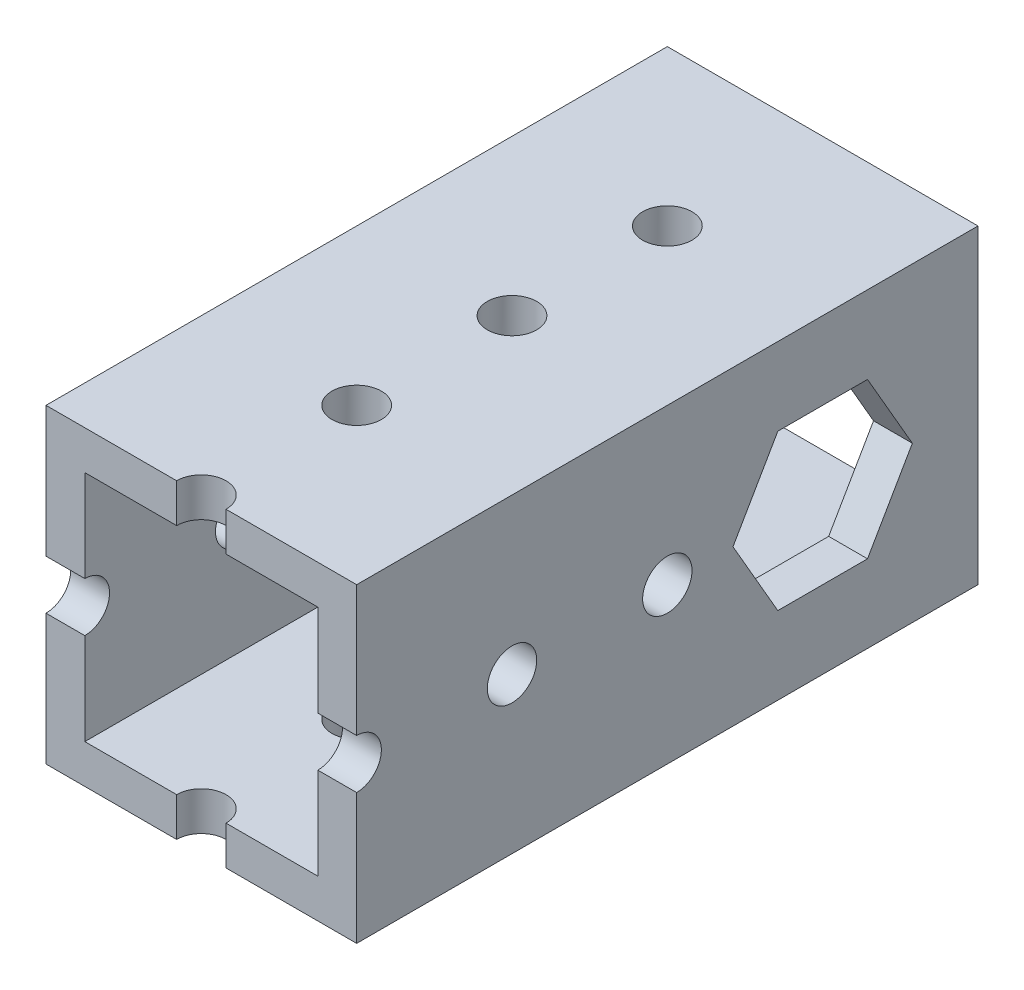
ISO-10303-21;
HEADER;
FILE_DESCRIPTION(('STEP AP214'),'2;1');
FILE_NAME('part.step','',(''),(''),'','','');
FILE_SCHEMA(('AUTOMOTIVE_DESIGN { 1 0 10303 214 1 1 1 1 }'));
ENDSEC;
DATA;
#1=APPLICATION_CONTEXT('core data for automotive mechanical design processes');
#2=APPLICATION_PROTOCOL_DEFINITION('international standard','automotive_design',2000,#1);
#3=PRODUCT_CONTEXT('',#1,'mechanical');
#4=PRODUCT('Part','Part','',(#3));
#5=PRODUCT_RELATED_PRODUCT_CATEGORY('part','',(#4));
#6=PRODUCT_DEFINITION_FORMATION('','',#4);
#7=PRODUCT_DEFINITION_CONTEXT('part definition',#1,'design');
#8=PRODUCT_DEFINITION('design','',#6,#7);
#9=PRODUCT_DEFINITION_SHAPE('','',#8);
#10=(LENGTH_UNIT() NAMED_UNIT(*) SI_UNIT(.MILLI.,.METRE.));
#11=(NAMED_UNIT(*) PLANE_ANGLE_UNIT() SI_UNIT($,.RADIAN.));
#12=(NAMED_UNIT(*) SI_UNIT($,.STERADIAN.) SOLID_ANGLE_UNIT());
#13=UNCERTAINTY_MEASURE_WITH_UNIT(LENGTH_MEASURE(1.E-05),#10,'distance_accuracy_value','');
#14=(GEOMETRIC_REPRESENTATION_CONTEXT(3) GLOBAL_UNCERTAINTY_ASSIGNED_CONTEXT((#13)) GLOBAL_UNIT_ASSIGNED_CONTEXT((#10,
#11,#12)) REPRESENTATION_CONTEXT('',''));
#15=CARTESIAN_POINT('',(0.,0.,0.));
#16=DIRECTION('',(0.,0.,1.));
#17=DIRECTION('',(1.,0.,0.));
#18=AXIS2_PLACEMENT_3D('',#15,#16,#17);
#19=CARTESIAN_POINT('',(0.,0.,63.5));
#20=DIRECTION('',(1.,0.,0.));
#21=DIRECTION('',(0.,0.,-1.));
#22=AXIS2_PLACEMENT_3D('',#19,#20,#21);
#23=PLANE('',#22);
#24=CARTESIAN_POINT('',(0.,12.7,25.4));
#25=DIRECTION('',(1.,0.,0.));
#26=DIRECTION('',(0.,0.,-1.));
#27=AXIS2_PLACEMENT_3D('',#24,#25,#26);
#28=CIRCLE('',#27,2.0193);
#29=CARTESIAN_POINT('',(0.,12.7,23.3807));
#30=VERTEX_POINT('',#29);
#31=EDGE_CURVE('E298',#30,#30,#28,.T.);
#32=ORIENTED_EDGE('',*,*,#31,.T.);
#33=EDGE_LOOP('',(#32));
#34=FACE_BOUND('',#33,.T.);
#35=CARTESIAN_POINT('',(0.,12.7,38.1));
#36=DIRECTION('',(1.,0.,0.));
#37=DIRECTION('',(0.,0.,-1.));
#38=AXIS2_PLACEMENT_3D('',#35,#36,#37);
#39=CIRCLE('',#38,2.01929999999999);
#40=CARTESIAN_POINT('',(0.,12.7,36.0807));
#41=VERTEX_POINT('',#40);
#42=EDGE_CURVE('E303',#41,#41,#39,.T.);
#43=ORIENTED_EDGE('',*,*,#42,.T.);
#44=EDGE_LOOP('',(#43));
#45=FACE_BOUND('',#44,.T.);
#46=DIRECTION('',(0.,0.866025403784439,-0.5));
#47=VECTOR('',#46,1.);
#48=CARTESIAN_POINT('',(0.,-21.9970452561247,25.4));
#49=LINE('',#48,#47);
#50=CARTESIAN_POINT('',(0.,6.35,9.03382579064588));
#51=VERTEX_POINT('',#50);
#52=CARTESIAN_POINT('',(0.,12.7,5.36765158129176));
#53=VERTEX_POINT('',#52);
#54=EDGE_CURVE('E555',#51,#53,#49,.T.);
#55=ORIENTED_EDGE('',*,*,#54,.T.);
#56=DIRECTION('',(0.,0.866025403784439,0.5));
#57=VECTOR('',#56,1.);
#58=CARTESIAN_POINT('',(0.,28.3470452561247,14.4014773719376));
#59=LINE('',#58,#57);
#60=CARTESIAN_POINT('',(0.,19.05,9.03382579064588));
#61=VERTEX_POINT('',#60);
#62=EDGE_CURVE('E563',#53,#61,#59,.T.);
#63=ORIENTED_EDGE('',*,*,#62,.T.);
#64=DIRECTION('',(0.,0.,1.));
#65=VECTOR('',#64,1.);
#66=CARTESIAN_POINT('',(0.,19.05,63.5));
#67=LINE('',#66,#65);
#68=CARTESIAN_POINT('',(0.,19.05,16.3661742093541));
#69=VERTEX_POINT('',#68);
#70=EDGE_CURVE('E527',#61,#69,#67,.T.);
#71=ORIENTED_EDGE('',*,*,#70,.T.);
#72=DIRECTION('',(0.,-0.866025403784439,0.5));
#73=VECTOR('',#72,1.);
#74=CARTESIAN_POINT('',(0.,-15.6470452561247,36.3985226280624));
#75=LINE('',#74,#73);
#76=CARTESIAN_POINT('',(0.,12.7,20.0323484187082));
#77=VERTEX_POINT('',#76);
#78=EDGE_CURVE('E534',#69,#77,#75,.T.);
#79=ORIENTED_EDGE('',*,*,#78,.T.);
#80=DIRECTION('',(0.,-0.866025403784439,-0.5));
#81=VECTOR('',#80,1.);
#82=CARTESIAN_POINT('',(0.,21.9970452561247,25.4));
#83=LINE('',#82,#81);
#84=CARTESIAN_POINT('',(0.,6.35,16.3661742093541));
#85=VERTEX_POINT('',#84);
#86=EDGE_CURVE('E541',#77,#85,#83,.T.);
#87=ORIENTED_EDGE('',*,*,#86,.T.);
#88=DIRECTION('',(0.,0.,-1.));
#89=VECTOR('',#88,1.);
#90=CARTESIAN_POINT('',(0.,6.35000000000001,63.5));
#91=LINE('',#90,#89);
#92=EDGE_CURVE('E548',#85,#51,#91,.T.);
#93=ORIENTED_EDGE('',*,*,#92,.T.);
#94=EDGE_LOOP('',(#55,#63,#71,#79,#87,#93));
#95=FACE_BOUND('',#94,.T.);
#96=DIRECTION('',(0.,-1.,0.));
#97=VECTOR('',#96,1.);
#98=CARTESIAN_POINT('',(0.,25.4,50.8));
#99=LINE('',#98,#97);
#100=CARTESIAN_POINT('',(0.,25.4,50.8));
#101=VERTEX_POINT('',#100);
#102=CARTESIAN_POINT('',(0.,14.7193,50.8));
#103=VERTEX_POINT('',#102);
#104=EDGE_CURVE('E232',#101,#103,#99,.T.);
#105=ORIENTED_EDGE('',*,*,#104,.F.);
#106=DIRECTION('',(0.,0.,-1.));
#107=VECTOR('',#106,1.);
#108=CARTESIAN_POINT('',(0.,25.4,63.5));
#109=LINE('',#108,#107);
#110=CARTESIAN_POINT('',(0.,25.4,0.));
#111=VERTEX_POINT('',#110);
#112=EDGE_CURVE('E427',#101,#111,#109,.T.);
#113=ORIENTED_EDGE('',*,*,#112,.T.);
#114=DIRECTION('',(0.,-1.,0.));
#115=VECTOR('',#114,1.);
#116=CARTESIAN_POINT('',(0.,0.,0.));
#117=LINE('',#116,#115);
#118=CARTESIAN_POINT('',(0.,0.,0.));
#119=VERTEX_POINT('',#118);
#120=EDGE_CURVE('E250',#111,#119,#117,.T.);
#121=ORIENTED_EDGE('',*,*,#120,.T.);
#122=DIRECTION('',(0.,0.,-1.));
#123=VECTOR('',#122,1.);
#124=CARTESIAN_POINT('',(0.,0.,63.5));
#125=LINE('',#124,#123);
#126=CARTESIAN_POINT('',(0.,0.,50.8));
#127=VERTEX_POINT('',#126);
#128=EDGE_CURVE('E238',#127,#119,#125,.T.);
#129=ORIENTED_EDGE('',*,*,#128,.F.);
#130=CARTESIAN_POINT('',(0.,10.6807,50.8));
#131=VERTEX_POINT('',#130);
#132=EDGE_CURVE('E221',#131,#127,#99,.T.);
#133=ORIENTED_EDGE('',*,*,#132,.F.);
#134=CARTESIAN_POINT('',(0.,12.7,50.8));
#135=DIRECTION('',(1.,0.,0.));
#136=DIRECTION('',(0.,0.,-1.));
#137=AXIS2_PLACEMENT_3D('',#134,#135,#136);
#138=CIRCLE('',#137,2.0193);
#139=EDGE_CURVE('E342',#131,#103,#138,.T.);
#140=ORIENTED_EDGE('',*,*,#139,.T.);
#141=EDGE_LOOP('',(#105,#113,#121,#129,#133,#140));
#142=FACE_BOUND('',#141,.T.);
#143=ADVANCED_FACE('F38',(#34,#45,#95,#142),#23,.F.);
#144=CARTESIAN_POINT('',(0.,0.,63.5));
#145=DIRECTION('',(0.,1.,0.));
#146=DIRECTION('',(0.,0.,1.));
#147=AXIS2_PLACEMENT_3D('',#144,#145,#146);
#148=PLANE('',#147);
#149=CARTESIAN_POINT('',(12.7,0.,12.7));
#150=DIRECTION('',(0.,1.,0.));
#151=DIRECTION('',(0.,0.,1.));
#152=AXIS2_PLACEMENT_3D('',#149,#150,#151);
#153=CIRCLE('',#152,2.0193);
#154=CARTESIAN_POINT('',(12.7,0.,14.7193));
#155=VERTEX_POINT('',#154);
#156=EDGE_CURVE('E274',#155,#155,#153,.T.);
#157=ORIENTED_EDGE('',*,*,#156,.T.);
#158=EDGE_LOOP('',(#157));
#159=FACE_BOUND('',#158,.T.);
#160=CARTESIAN_POINT('',(12.7,0.,25.4));
#161=DIRECTION('',(0.,1.,0.));
#162=DIRECTION('',(0.,0.,1.));
#163=AXIS2_PLACEMENT_3D('',#160,#161,#162);
#164=CIRCLE('',#163,2.0193);
#165=CARTESIAN_POINT('',(12.7,0.,27.4193));
#166=VERTEX_POINT('',#165);
#167=EDGE_CURVE('E280',#166,#166,#164,.T.);
#168=ORIENTED_EDGE('',*,*,#167,.T.);
#169=EDGE_LOOP('',(#168));
#170=FACE_BOUND('',#169,.T.);
#171=CARTESIAN_POINT('',(12.7,0.,38.1));
#172=DIRECTION('',(0.,1.,0.));
#173=DIRECTION('',(0.,0.,1.));
#174=AXIS2_PLACEMENT_3D('',#171,#172,#173);
#175=CIRCLE('',#174,2.0193);
#176=CARTESIAN_POINT('',(12.7,0.,40.1193));
#177=VERTEX_POINT('',#176);
#178=EDGE_CURVE('E286',#177,#177,#175,.T.);
#179=ORIENTED_EDGE('',*,*,#178,.T.);
#180=EDGE_LOOP('',(#179));
#181=FACE_BOUND('',#180,.T.);
#182=DIRECTION('',(1.,0.,0.));
#183=VECTOR('',#182,1.);
#184=CARTESIAN_POINT('',(0.,0.,50.8));
#185=LINE('',#184,#183);
#186=CARTESIAN_POINT('',(10.6807,0.,50.8));
#187=VERTEX_POINT('',#186);
#188=EDGE_CURVE('E224',#127,#187,#185,.T.);
#189=ORIENTED_EDGE('',*,*,#188,.F.);
#190=ORIENTED_EDGE('',*,*,#128,.T.);
#191=DIRECTION('',(1.,0.,0.));
#192=VECTOR('',#191,1.);
#193=CARTESIAN_POINT('',(0.,0.,0.));
#194=LINE('',#193,#192);
#195=CARTESIAN_POINT('',(25.4,0.,0.));
#196=VERTEX_POINT('',#195);
#197=EDGE_CURVE('E416',#119,#196,#194,.T.);
#198=ORIENTED_EDGE('',*,*,#197,.T.);
#199=DIRECTION('',(0.,0.,-1.));
#200=VECTOR('',#199,1.);
#201=CARTESIAN_POINT('',(25.4,0.,63.5));
#202=LINE('',#201,#200);
#203=CARTESIAN_POINT('',(25.4,0.,50.8));
#204=VERTEX_POINT('',#203);
#205=EDGE_CURVE('E253',#204,#196,#202,.T.);
#206=ORIENTED_EDGE('',*,*,#205,.F.);
#207=CARTESIAN_POINT('',(14.7193,0.,50.8));
#208=VERTEX_POINT('',#207);
#209=EDGE_CURVE('E245',#208,#204,#185,.T.);
#210=ORIENTED_EDGE('',*,*,#209,.F.);
#211=CARTESIAN_POINT('',(12.7,0.,50.8));
#212=DIRECTION('',(0.,1.,0.));
#213=DIRECTION('',(0.,0.,1.));
#214=AXIS2_PLACEMENT_3D('',#211,#212,#213);
#215=CIRCLE('',#214,2.0193);
#216=EDGE_CURVE('E242',#208,#187,#215,.T.);
#217=ORIENTED_EDGE('',*,*,#216,.T.);
#218=EDGE_LOOP('',(#189,#190,#198,#206,#210,#217));
#219=FACE_BOUND('',#218,.T.);
#220=ADVANCED_FACE('F236',(#159,#170,#181,#219),#148,.F.);
#221=CARTESIAN_POINT('',(25.4,0.,63.5));
#222=DIRECTION('',(-1.,0.,0.));
#223=DIRECTION('',(0.,0.,1.));
#224=AXIS2_PLACEMENT_3D('',#221,#222,#223);
#225=PLANE('',#224);
#226=CARTESIAN_POINT('',(25.4,12.7,25.4));
#227=DIRECTION('',(1.,0.,0.));
#228=DIRECTION('',(0.,0.,-1.));
#229=AXIS2_PLACEMENT_3D('',#226,#227,#228);
#230=CIRCLE('',#229,2.0193);
#231=CARTESIAN_POINT('',(25.4,12.7,23.3807));
#232=VERTEX_POINT('',#231);
#233=EDGE_CURVE('E567',#232,#232,#230,.T.);
#234=ORIENTED_EDGE('',*,*,#233,.F.);
#235=EDGE_LOOP('',(#234));
#236=FACE_BOUND('',#235,.T.);
#237=CARTESIAN_POINT('',(25.4,12.7,38.1));
#238=DIRECTION('',(1.,0.,0.));
#239=DIRECTION('',(0.,0.,-1.));
#240=AXIS2_PLACEMENT_3D('',#237,#238,#239);
#241=CIRCLE('',#240,2.01929999999999);
#242=CARTESIAN_POINT('',(25.4,12.7,36.0807));
#243=VERTEX_POINT('',#242);
#244=EDGE_CURVE('E571',#243,#243,#241,.T.);
#245=ORIENTED_EDGE('',*,*,#244,.F.);
#246=EDGE_LOOP('',(#245));
#247=FACE_BOUND('',#246,.T.);
#248=DIRECTION('',(0.,0.,1.));
#249=VECTOR('',#248,1.);
#250=CARTESIAN_POINT('',(25.4,19.05,9.03382579064588));
#251=LINE('',#250,#249);
#252=CARTESIAN_POINT('',(25.4,19.05,9.03382579064588));
#253=VERTEX_POINT('',#252);
#254=CARTESIAN_POINT('',(25.4,19.05,16.3661742093541));
#255=VERTEX_POINT('',#254);
#256=EDGE_CURVE('E479',#253,#255,#251,.T.);
#257=ORIENTED_EDGE('',*,*,#256,.F.);
#258=DIRECTION('',(0.,0.866025403784439,0.5));
#259=VECTOR('',#258,1.);
#260=CARTESIAN_POINT('',(25.4,12.7,5.36765158129176));
#261=LINE('',#260,#259);
#262=CARTESIAN_POINT('',(25.4,12.7,5.36765158129176));
#263=VERTEX_POINT('',#262);
#264=EDGE_CURVE('E476',#263,#253,#261,.T.);
#265=ORIENTED_EDGE('',*,*,#264,.F.);
#266=DIRECTION('',(0.,0.866025403784438,-0.5));
#267=VECTOR('',#266,1.);
#268=CARTESIAN_POINT('',(25.4,6.35,9.03382579064588));
#269=LINE('',#268,#267);
#270=CARTESIAN_POINT('',(25.4,6.35,9.03382579064588));
#271=VERTEX_POINT('',#270);
#272=EDGE_CURVE('E495',#271,#263,#269,.T.);
#273=ORIENTED_EDGE('',*,*,#272,.F.);
#274=DIRECTION('',(0.,0.,-1.));
#275=VECTOR('',#274,1.);
#276=CARTESIAN_POINT('',(25.4,6.35,16.3661742093541));
#277=LINE('',#276,#275);
#278=CARTESIAN_POINT('',(25.4,6.35,16.3661742093541));
#279=VERTEX_POINT('',#278);
#280=EDGE_CURVE('E491',#279,#271,#277,.T.);
#281=ORIENTED_EDGE('',*,*,#280,.F.);
#282=DIRECTION('',(0.,-0.866025403784439,-0.5));
#283=VECTOR('',#282,1.);
#284=CARTESIAN_POINT('',(25.4,12.7,20.0323484187082));
#285=LINE('',#284,#283);
#286=CARTESIAN_POINT('',(25.4,12.7,20.0323484187082));
#287=VERTEX_POINT('',#286);
#288=EDGE_CURVE('E487',#287,#279,#285,.T.);
#289=ORIENTED_EDGE('',*,*,#288,.F.);
#290=DIRECTION('',(0.,-0.866025403784439,0.5));
#291=VECTOR('',#290,1.);
#292=CARTESIAN_POINT('',(25.4,19.05,16.3661742093541));
#293=LINE('',#292,#291);
#294=EDGE_CURVE('E483',#255,#287,#293,.T.);
#295=ORIENTED_EDGE('',*,*,#294,.F.);
#296=EDGE_LOOP('',(#257,#265,#273,#281,#289,#295));
#297=FACE_BOUND('',#296,.T.);
#298=DIRECTION('',(0.,1.,0.));
#299=VECTOR('',#298,1.);
#300=CARTESIAN_POINT('',(25.4,25.4,50.8));
#301=LINE('',#300,#299);
#302=CARTESIAN_POINT('',(25.4,10.6807,50.8));
#303=VERTEX_POINT('',#302);
#304=EDGE_CURVE('E53',#204,#303,#301,.T.);
#305=ORIENTED_EDGE('',*,*,#304,.F.);
#306=ORIENTED_EDGE('',*,*,#205,.T.);
#307=DIRECTION('',(0.,1.,0.));
#308=VECTOR('',#307,1.);
#309=CARTESIAN_POINT('',(25.4,0.,0.));
#310=LINE('',#309,#308);
#311=CARTESIAN_POINT('',(25.4,25.4,0.));
#312=VERTEX_POINT('',#311);
#313=EDGE_CURVE('E419',#196,#312,#310,.T.);
#314=ORIENTED_EDGE('',*,*,#313,.T.);
#315=DIRECTION('',(0.,0.,-1.));
#316=VECTOR('',#315,1.);
#317=CARTESIAN_POINT('',(25.4,25.4,63.5));
#318=LINE('',#317,#316);
#319=CARTESIAN_POINT('',(25.4,25.4,50.8));
#320=VERTEX_POINT('',#319);
#321=EDGE_CURVE('E259',#320,#312,#318,.T.);
#322=ORIENTED_EDGE('',*,*,#321,.F.);
#323=CARTESIAN_POINT('',(25.4,14.7193,50.8));
#324=VERTEX_POINT('',#323);
#325=EDGE_CURVE('E244',#324,#320,#301,.T.);
#326=ORIENTED_EDGE('',*,*,#325,.F.);
#327=CARTESIAN_POINT('',(25.4,12.7,50.8));
#328=DIRECTION('',(1.,0.,0.));
#329=DIRECTION('',(0.,0.,-1.));
#330=AXIS2_PLACEMENT_3D('',#327,#328,#329);
#331=CIRCLE('',#330,2.0193);
#332=EDGE_CURVE('E292',#303,#324,#331,.T.);
#333=ORIENTED_EDGE('',*,*,#332,.F.);
#334=EDGE_LOOP('',(#305,#306,#314,#322,#326,#333));
#335=FACE_BOUND('',#334,.T.);
#336=ADVANCED_FACE('F440',(#236,#247,#297,#335),#225,.F.);
#337=CARTESIAN_POINT('',(0.,25.4,63.5));
#338=DIRECTION('',(0.,-1.,0.));
#339=DIRECTION('',(0.,0.,-1.));
#340=AXIS2_PLACEMENT_3D('',#337,#338,#339);
#341=PLANE('',#340);
#342=CARTESIAN_POINT('',(12.7,25.4,12.7));
#343=DIRECTION('',(0.,1.,0.));
#344=DIRECTION('',(0.,0.,1.));
#345=AXIS2_PLACEMENT_3D('',#342,#343,#344);
#346=CIRCLE('',#345,2.0193);
#347=CARTESIAN_POINT('',(12.7,25.4,14.7193));
#348=VERTEX_POINT('',#347);
#349=EDGE_CURVE('E345',#348,#348,#346,.T.);
#350=ORIENTED_EDGE('',*,*,#349,.F.);
#351=EDGE_LOOP('',(#350));
#352=FACE_BOUND('',#351,.T.);
#353=CARTESIAN_POINT('',(12.7,25.4,25.4));
#354=DIRECTION('',(0.,1.,0.));
#355=DIRECTION('',(0.,0.,1.));
#356=AXIS2_PLACEMENT_3D('',#353,#354,#355);
#357=CIRCLE('',#356,2.0193);
#358=CARTESIAN_POINT('',(12.7,25.4,27.4193));
#359=VERTEX_POINT('',#358);
#360=EDGE_CURVE('E357',#359,#359,#357,.T.);
#361=ORIENTED_EDGE('',*,*,#360,.F.);
#362=EDGE_LOOP('',(#361));
#363=FACE_BOUND('',#362,.T.);
#364=CARTESIAN_POINT('',(12.7,25.4,38.1));
#365=DIRECTION('',(0.,1.,0.));
#366=DIRECTION('',(0.,0.,1.));
#367=AXIS2_PLACEMENT_3D('',#364,#365,#366);
#368=CIRCLE('',#367,2.0193);
#369=CARTESIAN_POINT('',(12.7,25.4,40.1193));
#370=VERTEX_POINT('',#369);
#371=EDGE_CURVE('E353',#370,#370,#368,.T.);
#372=ORIENTED_EDGE('',*,*,#371,.F.);
#373=EDGE_LOOP('',(#372));
#374=FACE_BOUND('',#373,.T.);
#375=DIRECTION('',(-1.,0.,0.));
#376=VECTOR('',#375,1.);
#377=CARTESIAN_POINT('',(0.,25.4,50.8));
#378=LINE('',#377,#376);
#379=CARTESIAN_POINT('',(14.7193,25.4,50.8));
#380=VERTEX_POINT('',#379);
#381=EDGE_CURVE('E337',#320,#380,#378,.T.);
#382=ORIENTED_EDGE('',*,*,#381,.F.);
#383=ORIENTED_EDGE('',*,*,#321,.T.);
#384=DIRECTION('',(-1.,0.,0.));
#385=VECTOR('',#384,1.);
#386=CARTESIAN_POINT('',(0.,25.4,0.));
#387=LINE('',#386,#385);
#388=EDGE_CURVE('E423',#312,#111,#387,.T.);
#389=ORIENTED_EDGE('',*,*,#388,.T.);
#390=ORIENTED_EDGE('',*,*,#112,.F.);
#391=CARTESIAN_POINT('',(10.6807,25.4,50.8));
#392=VERTEX_POINT('',#391);
#393=EDGE_CURVE('E764',#392,#101,#378,.T.);
#394=ORIENTED_EDGE('',*,*,#393,.F.);
#395=CARTESIAN_POINT('',(12.7,25.4,50.8));
#396=DIRECTION('',(0.,1.,0.));
#397=DIRECTION('',(0.,0.,1.));
#398=AXIS2_PLACEMENT_3D('',#395,#396,#397);
#399=CIRCLE('',#398,2.0193);
#400=EDGE_CURVE('E268',#380,#392,#399,.T.);
#401=ORIENTED_EDGE('',*,*,#400,.F.);
#402=EDGE_LOOP('',(#382,#383,#389,#390,#394,#401));
#403=FACE_BOUND('',#402,.T.);
#404=ADVANCED_FACE('F433',(#352,#363,#374,#403),#341,.F.);
#405=CARTESIAN_POINT('',(3.175,3.175,63.5));
#406=DIRECTION('',(1.,0.,0.));
#407=DIRECTION('',(0.,0.,-1.));
#408=AXIS2_PLACEMENT_3D('',#405,#406,#407);
#409=PLANE('',#408);
#410=DIRECTION('',(0.,0.866025403784439,0.5));
#411=VECTOR('',#410,1.);
#412=CARTESIAN_POINT('',(3.175,30.7282952561247,15.7762927004454));
#413=LINE('',#412,#411);
#414=CARTESIAN_POINT('',(3.175,12.7,5.36765158129176));
#415=VERTEX_POINT('',#414);
#416=CARTESIAN_POINT('',(3.175,19.05,9.03382579064588));
#417=VERTEX_POINT('',#416);
#418=EDGE_CURVE('E559',#415,#417,#413,.T.);
#419=ORIENTED_EDGE('',*,*,#418,.F.);
#420=DIRECTION('',(0.,0.866025403784439,-0.5));
#421=VECTOR('',#420,1.);
#422=CARTESIAN_POINT('',(3.175,-19.6157952561247,24.0251846714922));
#423=LINE('',#422,#421);
#424=CARTESIAN_POINT('',(3.175,6.35,9.03382579064588));
#425=VERTEX_POINT('',#424);
#426=EDGE_CURVE('E552',#425,#415,#423,.T.);
#427=ORIENTED_EDGE('',*,*,#426,.F.);
#428=DIRECTION('',(0.,0.,-1.));
#429=VECTOR('',#428,1.);
#430=CARTESIAN_POINT('',(3.175,6.35000000000001,63.5));
#431=LINE('',#430,#429);
#432=CARTESIAN_POINT('',(3.175,6.35,16.3661742093541));
#433=VERTEX_POINT('',#432);
#434=EDGE_CURVE('E545',#433,#425,#431,.T.);
#435=ORIENTED_EDGE('',*,*,#434,.F.);
#436=DIRECTION('',(0.,-0.866025403784439,-0.5));
#437=VECTOR('',#436,1.);
#438=CARTESIAN_POINT('',(3.175,24.3782952561247,26.7748153285078));
#439=LINE('',#438,#437);
#440=CARTESIAN_POINT('',(3.175,12.7,20.0323484187082));
#441=VERTEX_POINT('',#440);
#442=EDGE_CURVE('E538',#441,#433,#439,.T.);
#443=ORIENTED_EDGE('',*,*,#442,.F.);
#444=DIRECTION('',(0.,-0.866025403784439,0.5));
#445=VECTOR('',#444,1.);
#446=CARTESIAN_POINT('',(3.175,-13.2657952561247,35.0237072995546));
#447=LINE('',#446,#445);
#448=CARTESIAN_POINT('',(3.175,19.05,16.3661742093541));
#449=VERTEX_POINT('',#448);
#450=EDGE_CURVE('E531',#449,#441,#447,.T.);
#451=ORIENTED_EDGE('',*,*,#450,.F.);
#452=DIRECTION('',(0.,0.,1.));
#453=VECTOR('',#452,1.);
#454=CARTESIAN_POINT('',(3.175,19.05,63.5));
#455=LINE('',#454,#453);
#456=EDGE_CURVE('E524',#417,#449,#455,.T.);
#457=ORIENTED_EDGE('',*,*,#456,.F.);
#458=EDGE_LOOP('',(#419,#427,#435,#443,#451,#457));
#459=FACE_BOUND('',#458,.T.);
#460=CARTESIAN_POINT('',(3.175,12.7,38.1));
#461=DIRECTION('',(1.,0.,0.));
#462=DIRECTION('',(0.,0.,-1.));
#463=AXIS2_PLACEMENT_3D('',#460,#461,#462);
#464=CIRCLE('',#463,2.01929999999999);
#465=CARTESIAN_POINT('',(3.175,12.7,36.0807));
#466=VERTEX_POINT('',#465);
#467=EDGE_CURVE('E297',#466,#466,#464,.T.);
#468=ORIENTED_EDGE('',*,*,#467,.F.);
#469=EDGE_LOOP('',(#468));
#470=FACE_BOUND('',#469,.T.);
#471=CARTESIAN_POINT('',(3.175,12.7,25.4));
#472=DIRECTION('',(1.,0.,0.));
#473=DIRECTION('',(0.,0.,-1.));
#474=AXIS2_PLACEMENT_3D('',#471,#472,#473);
#475=CIRCLE('',#474,2.0193);
#476=CARTESIAN_POINT('',(3.175,12.7,23.3807));
#477=VERTEX_POINT('',#476);
#478=EDGE_CURVE('E291',#477,#477,#475,.T.);
#479=ORIENTED_EDGE('',*,*,#478,.F.);
#480=EDGE_LOOP('',(#479));
#481=FACE_BOUND('',#480,.T.);
#482=DIRECTION('',(0.,0.,-1.));
#483=VECTOR('',#482,1.);
#484=CARTESIAN_POINT('',(3.175,22.225,63.5));
#485=LINE('',#484,#483);
#486=CARTESIAN_POINT('',(3.175,22.225,50.8));
#487=VERTEX_POINT('',#486);
#488=CARTESIAN_POINT('',(3.175,22.225,0.));
#489=VERTEX_POINT('',#488);
#490=EDGE_CURVE('E334',#487,#489,#485,.T.);
#491=ORIENTED_EDGE('',*,*,#490,.F.);
#492=DIRECTION('',(0.,-1.,0.));
#493=VECTOR('',#492,1.);
#494=CARTESIAN_POINT('',(3.175,3.175,50.8));
#495=LINE('',#494,#493);
#496=CARTESIAN_POINT('',(3.175,14.7193,50.8));
#497=VERTEX_POINT('',#496);
#498=EDGE_CURVE('E324',#487,#497,#495,.T.);
#499=ORIENTED_EDGE('',*,*,#498,.T.);
#500=CARTESIAN_POINT('',(3.175,12.7,50.8));
#501=DIRECTION('',(1.,0.,0.));
#502=DIRECTION('',(0.,0.,-1.));
#503=AXIS2_PLACEMENT_3D('',#500,#501,#502);
#504=CIRCLE('',#503,2.0193);
#505=CARTESIAN_POINT('',(3.175,10.6807,50.8));
#506=VERTEX_POINT('',#505);
#507=EDGE_CURVE('E302',#506,#497,#504,.T.);
#508=ORIENTED_EDGE('',*,*,#507,.F.);
#509=CARTESIAN_POINT('',(3.175,3.175,50.8));
#510=VERTEX_POINT('',#509);
#511=EDGE_CURVE('E339',#506,#510,#495,.T.);
#512=ORIENTED_EDGE('',*,*,#511,.T.);
#513=DIRECTION('',(0.,0.,-1.));
#514=VECTOR('',#513,1.);
#515=CARTESIAN_POINT('',(3.175,3.175,63.5));
#516=LINE('',#515,#514);
#517=CARTESIAN_POINT('',(3.175,3.175,0.));
#518=VERTEX_POINT('',#517);
#519=EDGE_CURVE('E411',#510,#518,#516,.T.);
#520=ORIENTED_EDGE('',*,*,#519,.T.);
#521=DIRECTION('',(0.,-1.,0.));
#522=VECTOR('',#521,1.);
#523=CARTESIAN_POINT('',(3.175,3.175,0.));
#524=LINE('',#523,#522);
#525=EDGE_CURVE('E387',#489,#518,#524,.T.);
#526=ORIENTED_EDGE('',*,*,#525,.F.);
#527=EDGE_LOOP('',(#491,#499,#508,#512,#520,#526));
#528=FACE_BOUND('',#527,.T.);
#529=ADVANCED_FACE('F331',(#459,#470,#481,#528),#409,.T.);
#530=CARTESIAN_POINT('',(3.175,3.175,63.5));
#531=DIRECTION('',(0.,1.,0.));
#532=DIRECTION('',(0.,0.,1.));
#533=AXIS2_PLACEMENT_3D('',#530,#531,#532);
#534=PLANE('',#533);
#535=CARTESIAN_POINT('',(12.7,3.175,38.1));
#536=DIRECTION('',(0.,1.,0.));
#537=DIRECTION('',(0.,0.,1.));
#538=AXIS2_PLACEMENT_3D('',#535,#536,#537);
#539=CIRCLE('',#538,2.0193);
#540=CARTESIAN_POINT('',(12.7,3.175,40.1193));
#541=VERTEX_POINT('',#540);
#542=EDGE_CURVE('E279',#541,#541,#539,.T.);
#543=ORIENTED_EDGE('',*,*,#542,.F.);
#544=EDGE_LOOP('',(#543));
#545=FACE_BOUND('',#544,.T.);
#546=CARTESIAN_POINT('',(12.7,3.175,25.4));
#547=DIRECTION('',(0.,1.,0.));
#548=DIRECTION('',(0.,0.,1.));
#549=AXIS2_PLACEMENT_3D('',#546,#547,#548);
#550=CIRCLE('',#549,2.0193);
#551=CARTESIAN_POINT('',(12.7,3.175,27.4193));
#552=VERTEX_POINT('',#551);
#553=EDGE_CURVE('E273',#552,#552,#550,.T.);
#554=ORIENTED_EDGE('',*,*,#553,.F.);
#555=EDGE_LOOP('',(#554));
#556=FACE_BOUND('',#555,.T.);
#557=CARTESIAN_POINT('',(12.7,3.175,12.7));
#558=DIRECTION('',(0.,1.,0.));
#559=DIRECTION('',(0.,0.,1.));
#560=AXIS2_PLACEMENT_3D('',#557,#558,#559);
#561=CIRCLE('',#560,2.0193);
#562=CARTESIAN_POINT('',(12.7,3.175,14.7193));
#563=VERTEX_POINT('',#562);
#564=EDGE_CURVE('E267',#563,#563,#561,.T.);
#565=ORIENTED_EDGE('',*,*,#564,.F.);
#566=EDGE_LOOP('',(#565));
#567=FACE_BOUND('',#566,.T.);
#568=ORIENTED_EDGE('',*,*,#519,.F.);
#569=DIRECTION('',(1.,0.,0.));
#570=VECTOR('',#569,1.);
#571=CARTESIAN_POINT('',(3.175,3.175,50.8));
#572=LINE('',#571,#570);
#573=CARTESIAN_POINT('',(10.6807,3.175,50.8));
#574=VERTEX_POINT('',#573);
#575=EDGE_CURVE('E455',#510,#574,#572,.T.);
#576=ORIENTED_EDGE('',*,*,#575,.T.);
#577=CARTESIAN_POINT('',(12.7,3.175,50.8));
#578=DIRECTION('',(0.,1.,0.));
#579=DIRECTION('',(0.,0.,1.));
#580=AXIS2_PLACEMENT_3D('',#577,#578,#579);
#581=CIRCLE('',#580,2.0193);
#582=CARTESIAN_POINT('',(14.7193,3.175,50.8));
#583=VERTEX_POINT('',#582);
#584=EDGE_CURVE('E285',#583,#574,#581,.T.);
#585=ORIENTED_EDGE('',*,*,#584,.F.);
#586=CARTESIAN_POINT('',(22.225,3.175,50.8));
#587=VERTEX_POINT('',#586);
#588=EDGE_CURVE('E461',#583,#587,#572,.T.);
#589=ORIENTED_EDGE('',*,*,#588,.T.);
#590=DIRECTION('',(0.,0.,-1.));
#591=VECTOR('',#590,1.);
#592=CARTESIAN_POINT('',(22.225,3.175,63.5));
#593=LINE('',#592,#591);
#594=CARTESIAN_POINT('',(22.225,3.175,0.));
#595=VERTEX_POINT('',#594);
#596=EDGE_CURVE('E408',#587,#595,#593,.T.);
#597=ORIENTED_EDGE('',*,*,#596,.T.);
#598=DIRECTION('',(1.,0.,0.));
#599=VECTOR('',#598,1.);
#600=CARTESIAN_POINT('',(3.175,3.175,0.));
#601=LINE('',#600,#599);
#602=EDGE_CURVE('E391',#518,#595,#601,.T.);
#603=ORIENTED_EDGE('',*,*,#602,.F.);
#604=EDGE_LOOP('',(#568,#576,#585,#589,#597,#603));
#605=FACE_BOUND('',#604,.T.);
#606=ADVANCED_FACE('F637',(#545,#556,#567,#605),#534,.T.);
#607=CARTESIAN_POINT('',(22.225,3.175,63.5));
#608=DIRECTION('',(-1.,0.,0.));
#609=DIRECTION('',(0.,0.,1.));
#610=AXIS2_PLACEMENT_3D('',#607,#608,#609);
#611=PLANE('',#610);
#612=DIRECTION('',(0.,-0.866025403784439,-0.5));
#613=VECTOR('',#612,1.);
#614=CARTESIAN_POINT('',(22.225,30.7282952561247,15.7762927004454));
#615=LINE('',#614,#613);
#616=CARTESIAN_POINT('',(22.225,19.05,9.03382579064588));
#617=VERTEX_POINT('',#616);
#618=CARTESIAN_POINT('',(22.225,12.7,5.36765158129176));
#619=VERTEX_POINT('',#618);
#620=EDGE_CURVE('E317',#617,#619,#615,.T.);
#621=ORIENTED_EDGE('',*,*,#620,.F.);
#622=DIRECTION('',(0.,0.,-1.));
#623=VECTOR('',#622,1.);
#624=CARTESIAN_POINT('',(22.225,19.05,63.5));
#625=LINE('',#624,#623);
#626=CARTESIAN_POINT('',(22.225,19.05,16.3661742093541));
#627=VERTEX_POINT('',#626);
#628=EDGE_CURVE('E252',#627,#617,#625,.T.);
#629=ORIENTED_EDGE('',*,*,#628,.F.);
#630=DIRECTION('',(0.,0.866025403784439,-0.5));
#631=VECTOR('',#630,1.);
#632=CARTESIAN_POINT('',(22.225,-13.2657952561247,35.0237072995546));
#633=LINE('',#632,#631);
#634=CARTESIAN_POINT('',(22.225,12.7,20.0323484187082));
#635=VERTEX_POINT('',#634);
#636=EDGE_CURVE('E257',#635,#627,#633,.T.);
#637=ORIENTED_EDGE('',*,*,#636,.F.);
#638=DIRECTION('',(0.,0.866025403784439,0.5));
#639=VECTOR('',#638,1.);
#640=CARTESIAN_POINT('',(22.225,24.3782952561247,26.7748153285078));
#641=LINE('',#640,#639);
#642=CARTESIAN_POINT('',(22.225,6.35,16.3661742093541));
#643=VERTEX_POINT('',#642);
#644=EDGE_CURVE('E308',#643,#635,#641,.T.);
#645=ORIENTED_EDGE('',*,*,#644,.F.);
#646=DIRECTION('',(0.,0.,1.));
#647=VECTOR('',#646,1.);
#648=CARTESIAN_POINT('',(22.225,6.35000000000001,63.5));
#649=LINE('',#648,#647);
#650=CARTESIAN_POINT('',(22.225,6.35,9.03382579064588));
#651=VERTEX_POINT('',#650);
#652=EDGE_CURVE('E311',#651,#643,#649,.T.);
#653=ORIENTED_EDGE('',*,*,#652,.F.);
#654=DIRECTION('',(0.,-0.866025403784439,0.5));
#655=VECTOR('',#654,1.);
#656=CARTESIAN_POINT('',(22.225,-19.6157952561247,24.0251846714922));
#657=LINE('',#656,#655);
#658=EDGE_CURVE('E314',#619,#651,#657,.T.);
#659=ORIENTED_EDGE('',*,*,#658,.F.);
#660=EDGE_LOOP('',(#621,#629,#637,#645,#653,#659));
#661=FACE_BOUND('',#660,.T.);
#662=CARTESIAN_POINT('',(22.225,12.7,38.1));
#663=DIRECTION('',(-1.,0.,0.));
#664=DIRECTION('',(0.,0.,1.));
#665=AXIS2_PLACEMENT_3D('',#662,#663,#664);
#666=CIRCLE('',#665,2.01929999999999);
#667=CARTESIAN_POINT('',(22.225,12.7,40.1193));
#668=VERTEX_POINT('',#667);
#669=EDGE_CURVE('E293',#668,#668,#666,.T.);
#670=ORIENTED_EDGE('',*,*,#669,.F.);
#671=EDGE_LOOP('',(#670));
#672=FACE_BOUND('',#671,.T.);
#673=CARTESIAN_POINT('',(22.225,12.7,25.4));
#674=DIRECTION('',(-1.,0.,0.));
#675=DIRECTION('',(0.,0.,1.));
#676=AXIS2_PLACEMENT_3D('',#673,#674,#675);
#677=CIRCLE('',#676,2.0193);
#678=CARTESIAN_POINT('',(22.225,12.7,27.4193));
#679=VERTEX_POINT('',#678);
#680=EDGE_CURVE('E287',#679,#679,#677,.T.);
#681=ORIENTED_EDGE('',*,*,#680,.F.);
#682=EDGE_LOOP('',(#681));
#683=FACE_BOUND('',#682,.T.);
#684=ORIENTED_EDGE('',*,*,#596,.F.);
#685=DIRECTION('',(0.,1.,0.));
#686=VECTOR('',#685,1.);
#687=CARTESIAN_POINT('',(22.225,3.175,50.8));
#688=LINE('',#687,#686);
#689=CARTESIAN_POINT('',(22.225,10.6807,50.8));
#690=VERTEX_POINT('',#689);
#691=EDGE_CURVE('E467',#587,#690,#688,.T.);
#692=ORIENTED_EDGE('',*,*,#691,.T.);
#693=CARTESIAN_POINT('',(22.225,12.7,50.8));
#694=DIRECTION('',(-1.,0.,0.));
#695=DIRECTION('',(0.,0.,1.));
#696=AXIS2_PLACEMENT_3D('',#693,#694,#695);
#697=CIRCLE('',#696,2.0193);
#698=CARTESIAN_POINT('',(22.225,14.7193,50.8));
#699=VERTEX_POINT('',#698);
#700=EDGE_CURVE('E299',#699,#690,#697,.T.);
#701=ORIENTED_EDGE('',*,*,#700,.F.);
#702=CARTESIAN_POINT('',(22.225,22.225,50.8));
#703=VERTEX_POINT('',#702);
#704=EDGE_CURVE('E61',#699,#703,#688,.T.);
#705=ORIENTED_EDGE('',*,*,#704,.T.);
#706=DIRECTION('',(0.,0.,-1.));
#707=VECTOR('',#706,1.);
#708=CARTESIAN_POINT('',(22.225,22.225,63.5));
#709=LINE('',#708,#707);
#710=CARTESIAN_POINT('',(22.225,22.225,0.));
#711=VERTEX_POINT('',#710);
#712=EDGE_CURVE('E405',#703,#711,#709,.T.);
#713=ORIENTED_EDGE('',*,*,#712,.T.);
#714=DIRECTION('',(0.,1.,0.));
#715=VECTOR('',#714,1.);
#716=CARTESIAN_POINT('',(22.225,3.175,0.));
#717=LINE('',#716,#715);
#718=EDGE_CURVE('E395',#595,#711,#717,.T.);
#719=ORIENTED_EDGE('',*,*,#718,.F.);
#720=EDGE_LOOP('',(#684,#692,#701,#705,#713,#719));
#721=FACE_BOUND('',#720,.T.);
#722=ADVANCED_FACE('F641',(#661,#672,#683,#721),#611,.T.);
#723=CARTESIAN_POINT('',(3.175,22.225,63.5));
#724=DIRECTION('',(0.,-1.,0.));
#725=DIRECTION('',(0.,0.,-1.));
#726=AXIS2_PLACEMENT_3D('',#723,#724,#725);
#727=PLANE('',#726);
#728=CARTESIAN_POINT('',(12.7,22.225,38.1));
#729=DIRECTION('',(0.,-1.,0.));
#730=DIRECTION('',(0.,0.,-1.));
#731=AXIS2_PLACEMENT_3D('',#728,#729,#730);
#732=CIRCLE('',#731,2.0193);
#733=CARTESIAN_POINT('',(12.7,22.225,36.0807));
#734=VERTEX_POINT('',#733);
#735=EDGE_CURVE('E275',#734,#734,#732,.T.);
#736=ORIENTED_EDGE('',*,*,#735,.F.);
#737=EDGE_LOOP('',(#736));
#738=FACE_BOUND('',#737,.T.);
#739=CARTESIAN_POINT('',(12.7,22.225,25.4));
#740=DIRECTION('',(0.,-1.,0.));
#741=DIRECTION('',(0.,0.,-1.));
#742=AXIS2_PLACEMENT_3D('',#739,#740,#741);
#743=CIRCLE('',#742,2.0193);
#744=CARTESIAN_POINT('',(12.7,22.225,23.3807));
#745=VERTEX_POINT('',#744);
#746=EDGE_CURVE('E269',#745,#745,#743,.T.);
#747=ORIENTED_EDGE('',*,*,#746,.F.);
#748=EDGE_LOOP('',(#747));
#749=FACE_BOUND('',#748,.T.);
#750=CARTESIAN_POINT('',(12.7,22.225,12.7));
#751=DIRECTION('',(0.,-1.,0.));
#752=DIRECTION('',(0.,0.,-1.));
#753=AXIS2_PLACEMENT_3D('',#750,#751,#752);
#754=CIRCLE('',#753,2.0193);
#755=CARTESIAN_POINT('',(12.7,22.225,10.6807));
#756=VERTEX_POINT('',#755);
#757=EDGE_CURVE('E263',#756,#756,#754,.T.);
#758=ORIENTED_EDGE('',*,*,#757,.F.);
#759=EDGE_LOOP('',(#758));
#760=FACE_BOUND('',#759,.T.);
#761=ORIENTED_EDGE('',*,*,#712,.F.);
#762=DIRECTION('',(-1.,0.,0.));
#763=VECTOR('',#762,1.);
#764=CARTESIAN_POINT('',(3.175,22.225,50.8));
#765=LINE('',#764,#763);
#766=CARTESIAN_POINT('',(14.7193,22.225,50.8));
#767=VERTEX_POINT('',#766);
#768=EDGE_CURVE('E466',#703,#767,#765,.T.);
#769=ORIENTED_EDGE('',*,*,#768,.T.);
#770=CARTESIAN_POINT('',(12.7,22.225,50.8));
#771=DIRECTION('',(0.,-1.,0.));
#772=DIRECTION('',(0.,0.,-1.));
#773=AXIS2_PLACEMENT_3D('',#770,#771,#772);
#774=CIRCLE('',#773,2.0193);
#775=CARTESIAN_POINT('',(10.6807,22.225,50.8));
#776=VERTEX_POINT('',#775);
#777=EDGE_CURVE('E281',#776,#767,#774,.T.);
#778=ORIENTED_EDGE('',*,*,#777,.F.);
#779=EDGE_CURVE('E336',#776,#487,#765,.T.);
#780=ORIENTED_EDGE('',*,*,#779,.T.);
#781=ORIENTED_EDGE('',*,*,#490,.T.);
#782=DIRECTION('',(-1.,0.,0.));
#783=VECTOR('',#782,1.);
#784=CARTESIAN_POINT('',(3.175,22.225,0.));
#785=LINE('',#784,#783);
#786=EDGE_CURVE('E399',#711,#489,#785,.T.);
#787=ORIENTED_EDGE('',*,*,#786,.F.);
#788=EDGE_LOOP('',(#761,#769,#778,#780,#781,#787));
#789=FACE_BOUND('',#788,.T.);
#790=ADVANCED_FACE('F645',(#738,#749,#760,#789),#727,.T.);
#791=CARTESIAN_POINT('',(12.7,-38.1,50.8));
#792=DIRECTION('',(0.,1.,0.));
#793=DIRECTION('',(0.,0.,1.));
#794=AXIS2_PLACEMENT_3D('',#791,#792,#793);
#795=CYLINDRICAL_SURFACE('',#794,2.0193);
#796=DIRECTION('',(0.,1.,0.));
#797=VECTOR('',#796,1.);
#798=CARTESIAN_POINT('',(14.7193,-38.1,50.8));
#799=LINE('',#798,#797);
#800=EDGE_CURVE('E468',#380,#767,#799,.F.);
#801=ORIENTED_EDGE('',*,*,#800,.F.);
#802=ORIENTED_EDGE('',*,*,#400,.T.);
#803=DIRECTION('',(0.,1.,0.));
#804=VECTOR('',#803,1.);
#805=CARTESIAN_POINT('',(10.6807,-38.1,50.8));
#806=LINE('',#805,#804);
#807=EDGE_CURVE('E755',#776,#392,#806,.T.);
#808=ORIENTED_EDGE('',*,*,#807,.F.);
#809=ORIENTED_EDGE('',*,*,#777,.T.);
#810=EDGE_LOOP('',(#801,#802,#808,#809));
#811=FACE_BOUND('',#810,.T.);
#812=ADVANCED_FACE('F649',(#811),#795,.F.);
#813=DIRECTION('',(0.,1.,0.));
#814=VECTOR('',#813,1.);
#815=CARTESIAN_POINT('',(14.7193,-38.1,50.8));
#816=LINE('',#815,#814);
#817=EDGE_CURVE('E449',#583,#208,#816,.F.);
#818=ORIENTED_EDGE('',*,*,#817,.F.);
#819=ORIENTED_EDGE('',*,*,#584,.T.);
#820=DIRECTION('',(0.,1.,0.));
#821=VECTOR('',#820,1.);
#822=CARTESIAN_POINT('',(10.6807,-38.1,50.8));
#823=LINE('',#822,#821);
#824=EDGE_CURVE('E451',#187,#574,#823,.T.);
#825=ORIENTED_EDGE('',*,*,#824,.F.);
#826=ORIENTED_EDGE('',*,*,#216,.F.);
#827=EDGE_LOOP('',(#818,#819,#825,#826));
#828=FACE_BOUND('',#827,.T.);
#829=ADVANCED_FACE('F448',(#828),#795,.F.);
#830=CARTESIAN_POINT('',(-38.1,12.7,50.8));
#831=DIRECTION('',(1.,0.,0.));
#832=DIRECTION('',(0.,0.,-1.));
#833=AXIS2_PLACEMENT_3D('',#830,#831,#832);
#834=CYLINDRICAL_SURFACE('',#833,2.0193);
#835=DIRECTION('',(1.,0.,0.));
#836=VECTOR('',#835,1.);
#837=CARTESIAN_POINT('',(-38.1,10.6807,50.8));
#838=LINE('',#837,#836);
#839=EDGE_CURVE('E471',#303,#690,#838,.F.);
#840=ORIENTED_EDGE('',*,*,#839,.F.);
#841=ORIENTED_EDGE('',*,*,#332,.T.);
#842=DIRECTION('',(1.,0.,0.));
#843=VECTOR('',#842,1.);
#844=CARTESIAN_POINT('',(-38.1,14.7193,50.8));
#845=LINE('',#844,#843);
#846=EDGE_CURVE('E454',#699,#324,#845,.T.);
#847=ORIENTED_EDGE('',*,*,#846,.F.);
#848=ORIENTED_EDGE('',*,*,#700,.T.);
#849=EDGE_LOOP('',(#840,#841,#847,#848));
#850=FACE_BOUND('',#849,.T.);
#851=ADVANCED_FACE('F773',(#850),#834,.F.);
#852=DIRECTION('',(1.,0.,0.));
#853=VECTOR('',#852,1.);
#854=CARTESIAN_POINT('',(-38.1,10.6807,50.8));
#855=LINE('',#854,#853);
#856=EDGE_CURVE('E11',#506,#131,#855,.F.);
#857=ORIENTED_EDGE('',*,*,#856,.F.);
#858=ORIENTED_EDGE('',*,*,#507,.T.);
#859=DIRECTION('',(1.,0.,0.));
#860=VECTOR('',#859,1.);
#861=CARTESIAN_POINT('',(-38.1,14.7193,50.8));
#862=LINE('',#861,#860);
#863=EDGE_CURVE('E46',#103,#497,#862,.T.);
#864=ORIENTED_EDGE('',*,*,#863,.F.);
#865=ORIENTED_EDGE('',*,*,#139,.F.);
#866=EDGE_LOOP('',(#857,#858,#864,#865));
#867=FACE_BOUND('',#866,.T.);
#868=ADVANCED_FACE('F340',(#867),#834,.F.);
#869=CARTESIAN_POINT('',(0.,0.,0.));
#870=DIRECTION('',(0.,0.,-1.));
#871=DIRECTION('',(-1.,0.,0.));
#872=AXIS2_PLACEMENT_3D('',#869,#870,#871);
#873=PLANE('',#872);
#874=ORIENTED_EDGE('',*,*,#120,.F.);
#875=ORIENTED_EDGE('',*,*,#388,.F.);
#876=ORIENTED_EDGE('',*,*,#313,.F.);
#877=ORIENTED_EDGE('',*,*,#197,.F.);
#878=EDGE_LOOP('',(#874,#875,#876,#877));
#879=FACE_BOUND('',#878,.T.);
#880=ORIENTED_EDGE('',*,*,#786,.T.);
#881=ORIENTED_EDGE('',*,*,#525,.T.);
#882=ORIENTED_EDGE('',*,*,#602,.T.);
#883=ORIENTED_EDGE('',*,*,#718,.T.);
#884=EDGE_LOOP('',(#880,#881,#882,#883));
#885=FACE_BOUND('',#884,.T.);
#886=ADVANCED_FACE('F443',(#879,#885),#873,.T.);
#887=CARTESIAN_POINT('',(12.7,-38.1,12.7));
#888=DIRECTION('',(0.,1.,0.));
#889=DIRECTION('',(0.,0.,1.));
#890=AXIS2_PLACEMENT_3D('',#887,#888,#889);
#891=CYLINDRICAL_SURFACE('',#890,2.0193);
#892=ORIENTED_EDGE('',*,*,#757,.T.);
#893=EDGE_LOOP('',(#892));
#894=FACE_BOUND('',#893,.T.);
#895=ORIENTED_EDGE('',*,*,#349,.T.);
#896=EDGE_LOOP('',(#895));
#897=FACE_BOUND('',#896,.T.);
#898=ADVANCED_FACE('F634',(#894,#897),#891,.F.);
#899=CARTESIAN_POINT('',(12.7,-38.1,25.4));
#900=DIRECTION('',(0.,1.,0.));
#901=DIRECTION('',(0.,0.,1.));
#902=AXIS2_PLACEMENT_3D('',#899,#900,#901);
#903=CYLINDRICAL_SURFACE('',#902,2.0193);
#904=ORIENTED_EDGE('',*,*,#746,.T.);
#905=EDGE_LOOP('',(#904));
#906=FACE_BOUND('',#905,.T.);
#907=ORIENTED_EDGE('',*,*,#360,.T.);
#908=EDGE_LOOP('',(#907));
#909=FACE_BOUND('',#908,.T.);
#910=ADVANCED_FACE('F653',(#906,#909),#903,.F.);
#911=CARTESIAN_POINT('',(12.7,-38.1,38.1));
#912=DIRECTION('',(0.,1.,0.));
#913=DIRECTION('',(0.,0.,1.));
#914=AXIS2_PLACEMENT_3D('',#911,#912,#913);
#915=CYLINDRICAL_SURFACE('',#914,2.0193);
#916=ORIENTED_EDGE('',*,*,#735,.T.);
#917=EDGE_LOOP('',(#916));
#918=FACE_BOUND('',#917,.T.);
#919=ORIENTED_EDGE('',*,*,#371,.T.);
#920=EDGE_LOOP('',(#919));
#921=FACE_BOUND('',#920,.T.);
#922=ADVANCED_FACE('F658',(#918,#921),#915,.F.);
#923=ORIENTED_EDGE('',*,*,#564,.T.);
#924=EDGE_LOOP('',(#923));
#925=FACE_BOUND('',#924,.T.);
#926=ORIENTED_EDGE('',*,*,#156,.F.);
#927=EDGE_LOOP('',(#926));
#928=FACE_BOUND('',#927,.T.);
#929=ADVANCED_FACE('F655',(#925,#928),#891,.F.);
#930=ORIENTED_EDGE('',*,*,#553,.T.);
#931=EDGE_LOOP('',(#930));
#932=FACE_BOUND('',#931,.T.);
#933=ORIENTED_EDGE('',*,*,#167,.F.);
#934=EDGE_LOOP('',(#933));
#935=FACE_BOUND('',#934,.T.);
#936=ADVANCED_FACE('F660',(#932,#935),#903,.F.);
#937=ORIENTED_EDGE('',*,*,#542,.T.);
#938=EDGE_LOOP('',(#937));
#939=FACE_BOUND('',#938,.T.);
#940=ORIENTED_EDGE('',*,*,#178,.F.);
#941=EDGE_LOOP('',(#940));
#942=FACE_BOUND('',#941,.T.);
#943=ADVANCED_FACE('F664',(#939,#942),#915,.F.);
#944=CARTESIAN_POINT('',(-38.1,12.7,25.4));
#945=DIRECTION('',(1.,0.,0.));
#946=DIRECTION('',(0.,0.,-1.));
#947=AXIS2_PLACEMENT_3D('',#944,#945,#946);
#948=CYLINDRICAL_SURFACE('',#947,2.0193);
#949=ORIENTED_EDGE('',*,*,#680,.T.);
#950=EDGE_LOOP('',(#949));
#951=FACE_BOUND('',#950,.T.);
#952=ORIENTED_EDGE('',*,*,#233,.T.);
#953=EDGE_LOOP('',(#952));
#954=FACE_BOUND('',#953,.T.);
#955=ADVANCED_FACE('F609',(#951,#954),#948,.F.);
#956=CARTESIAN_POINT('',(-38.1,12.7,38.1));
#957=DIRECTION('',(1.,0.,0.));
#958=DIRECTION('',(0.,0.,-1.));
#959=AXIS2_PLACEMENT_3D('',#956,#957,#958);
#960=CYLINDRICAL_SURFACE('',#959,2.01929999999999);
#961=ORIENTED_EDGE('',*,*,#669,.T.);
#962=EDGE_LOOP('',(#961));
#963=FACE_BOUND('',#962,.T.);
#964=ORIENTED_EDGE('',*,*,#244,.T.);
#965=EDGE_LOOP('',(#964));
#966=FACE_BOUND('',#965,.T.);
#967=ADVANCED_FACE('F598',(#963,#966),#960,.F.);
#968=ORIENTED_EDGE('',*,*,#478,.T.);
#969=EDGE_LOOP('',(#968));
#970=FACE_BOUND('',#969,.T.);
#971=ORIENTED_EDGE('',*,*,#31,.F.);
#972=EDGE_LOOP('',(#971));
#973=FACE_BOUND('',#972,.T.);
#974=ADVANCED_FACE('F596',(#970,#973),#948,.F.);
#975=ORIENTED_EDGE('',*,*,#467,.T.);
#976=EDGE_LOOP('',(#975));
#977=FACE_BOUND('',#976,.T.);
#978=ORIENTED_EDGE('',*,*,#42,.F.);
#979=EDGE_LOOP('',(#978));
#980=FACE_BOUND('',#979,.T.);
#981=ADVANCED_FACE('F593',(#977,#980),#960,.F.);
#982=CARTESIAN_POINT('',(-3.30199999999999,19.05,9.03382579064588));
#983=DIRECTION('',(0.,1.,0.));
#984=DIRECTION('',(0.,0.,1.));
#985=AXIS2_PLACEMENT_3D('',#982,#983,#984);
#986=PLANE('',#985);
#987=ORIENTED_EDGE('',*,*,#628,.T.);
#988=DIRECTION('',(1.,0.,0.));
#989=VECTOR('',#988,1.);
#990=CARTESIAN_POINT('',(-3.30199999999999,19.05,9.03382579064588));
#991=LINE('',#990,#989);
#992=EDGE_CURVE('E499',#617,#253,#991,.T.);
#993=ORIENTED_EDGE('',*,*,#992,.T.);
#994=ORIENTED_EDGE('',*,*,#256,.T.);
#995=DIRECTION('',(1.,0.,0.));
#996=VECTOR('',#995,1.);
#997=CARTESIAN_POINT('',(-3.30199999999999,19.05,16.3661742093541));
#998=LINE('',#997,#996);
#999=EDGE_CURVE('E517',#627,#255,#998,.T.);
#1000=ORIENTED_EDGE('',*,*,#999,.F.);
#1001=EDGE_LOOP('',(#987,#993,#994,#1000));
#1002=FACE_BOUND('',#1001,.T.);
#1003=ADVANCED_FACE('F595',(#1002),#986,.F.);
#1004=CARTESIAN_POINT('',(-3.30199999999999,19.05,16.3661742093541));
#1005=DIRECTION('',(0.,0.5,0.866025403784439));
#1006=DIRECTION('',(0.,-0.866025403784439,0.5));
#1007=AXIS2_PLACEMENT_3D('',#1004,#1005,#1006);
#1008=PLANE('',#1007);
#1009=ORIENTED_EDGE('',*,*,#636,.T.);
#1010=ORIENTED_EDGE('',*,*,#999,.T.);
#1011=ORIENTED_EDGE('',*,*,#294,.T.);
#1012=DIRECTION('',(1.,0.,0.));
#1013=VECTOR('',#1012,1.);
#1014=CARTESIAN_POINT('',(-3.30199999999999,12.7,20.0323484187082));
#1015=LINE('',#1014,#1013);
#1016=EDGE_CURVE('E513',#635,#287,#1015,.T.);
#1017=ORIENTED_EDGE('',*,*,#1016,.F.);
#1018=EDGE_LOOP('',(#1009,#1010,#1011,#1017));
#1019=FACE_BOUND('',#1018,.T.);
#1020=ADVANCED_FACE('F603',(#1019),#1008,.F.);
#1021=CARTESIAN_POINT('',(-3.30199999999999,12.7,20.0323484187082));
#1022=DIRECTION('',(0.,-0.5,0.866025403784439));
#1023=DIRECTION('',(0.,-0.866025403784439,-0.5));
#1024=AXIS2_PLACEMENT_3D('',#1021,#1022,#1023);
#1025=PLANE('',#1024);
#1026=ORIENTED_EDGE('',*,*,#644,.T.);
#1027=ORIENTED_EDGE('',*,*,#1016,.T.);
#1028=ORIENTED_EDGE('',*,*,#288,.T.);
#1029=DIRECTION('',(1.,0.,0.));
#1030=VECTOR('',#1029,1.);
#1031=CARTESIAN_POINT('',(-3.30199999999999,6.35,16.3661742093541));
#1032=LINE('',#1031,#1030);
#1033=EDGE_CURVE('E509',#643,#279,#1032,.T.);
#1034=ORIENTED_EDGE('',*,*,#1033,.F.);
#1035=EDGE_LOOP('',(#1026,#1027,#1028,#1034));
#1036=FACE_BOUND('',#1035,.T.);
#1037=ADVANCED_FACE('F703',(#1036),#1025,.F.);
#1038=CARTESIAN_POINT('',(-3.30199999999999,6.35,16.3661742093541));
#1039=DIRECTION('',(0.,-1.,0.));
#1040=DIRECTION('',(0.,0.,-1.));
#1041=AXIS2_PLACEMENT_3D('',#1038,#1039,#1040);
#1042=PLANE('',#1041);
#1043=ORIENTED_EDGE('',*,*,#652,.T.);
#1044=ORIENTED_EDGE('',*,*,#1033,.T.);
#1045=ORIENTED_EDGE('',*,*,#280,.T.);
#1046=DIRECTION('',(1.,0.,0.));
#1047=VECTOR('',#1046,1.);
#1048=CARTESIAN_POINT('',(-3.30199999999999,6.35,9.03382579064588));
#1049=LINE('',#1048,#1047);
#1050=EDGE_CURVE('E505',#651,#271,#1049,.T.);
#1051=ORIENTED_EDGE('',*,*,#1050,.F.);
#1052=EDGE_LOOP('',(#1043,#1044,#1045,#1051));
#1053=FACE_BOUND('',#1052,.T.);
#1054=ADVANCED_FACE('F699',(#1053),#1042,.F.);
#1055=CARTESIAN_POINT('',(-3.30199999999999,6.35,9.03382579064588));
#1056=DIRECTION('',(0.,-0.5,-0.866025403784438));
#1057=DIRECTION('',(0.,0.866025403784439,-0.5));
#1058=AXIS2_PLACEMENT_3D('',#1055,#1056,#1057);
#1059=PLANE('',#1058);
#1060=ORIENTED_EDGE('',*,*,#658,.T.);
#1061=ORIENTED_EDGE('',*,*,#1050,.T.);
#1062=ORIENTED_EDGE('',*,*,#272,.T.);
#1063=DIRECTION('',(1.,0.,0.));
#1064=VECTOR('',#1063,1.);
#1065=CARTESIAN_POINT('',(-3.30199999999999,12.7,5.36765158129176));
#1066=LINE('',#1065,#1064);
#1067=EDGE_CURVE('E500',#619,#263,#1066,.T.);
#1068=ORIENTED_EDGE('',*,*,#1067,.F.);
#1069=EDGE_LOOP('',(#1060,#1061,#1062,#1068));
#1070=FACE_BOUND('',#1069,.T.);
#1071=ADVANCED_FACE('F697',(#1070),#1059,.F.);
#1072=CARTESIAN_POINT('',(-3.30199999999999,12.7,5.36765158129176));
#1073=DIRECTION('',(0.,0.5,-0.866025403784439));
#1074=DIRECTION('',(0.,0.866025403784439,0.5));
#1075=AXIS2_PLACEMENT_3D('',#1072,#1073,#1074);
#1076=PLANE('',#1075);
#1077=ORIENTED_EDGE('',*,*,#620,.T.);
#1078=ORIENTED_EDGE('',*,*,#1067,.T.);
#1079=ORIENTED_EDGE('',*,*,#264,.T.);
#1080=ORIENTED_EDGE('',*,*,#992,.F.);
#1081=EDGE_LOOP('',(#1077,#1078,#1079,#1080));
#1082=FACE_BOUND('',#1081,.T.);
#1083=ADVANCED_FACE('F688',(#1082),#1076,.F.);
#1084=EDGE_CURVE('E503',#53,#415,#1066,.T.);
#1085=ORIENTED_EDGE('',*,*,#1084,.T.);
#1086=ORIENTED_EDGE('',*,*,#418,.T.);
#1087=EDGE_CURVE('E520',#61,#417,#991,.T.);
#1088=ORIENTED_EDGE('',*,*,#1087,.F.);
#1089=ORIENTED_EDGE('',*,*,#62,.F.);
#1090=EDGE_LOOP('',(#1085,#1086,#1088,#1089));
#1091=FACE_BOUND('',#1090,.T.);
#1092=ADVANCED_FACE('F910',(#1091),#1076,.F.);
#1093=EDGE_CURVE('E504',#51,#425,#1049,.T.);
#1094=ORIENTED_EDGE('',*,*,#1093,.T.);
#1095=ORIENTED_EDGE('',*,*,#426,.T.);
#1096=ORIENTED_EDGE('',*,*,#1084,.F.);
#1097=ORIENTED_EDGE('',*,*,#54,.F.);
#1098=EDGE_LOOP('',(#1094,#1095,#1096,#1097));
#1099=FACE_BOUND('',#1098,.T.);
#1100=ADVANCED_FACE('F902',(#1099),#1059,.F.);
#1101=EDGE_CURVE('E508',#85,#433,#1032,.T.);
#1102=ORIENTED_EDGE('',*,*,#1101,.T.);
#1103=ORIENTED_EDGE('',*,*,#434,.T.);
#1104=ORIENTED_EDGE('',*,*,#1093,.F.);
#1105=ORIENTED_EDGE('',*,*,#92,.F.);
#1106=EDGE_LOOP('',(#1102,#1103,#1104,#1105));
#1107=FACE_BOUND('',#1106,.T.);
#1108=ADVANCED_FACE('F721',(#1107),#1042,.F.);
#1109=EDGE_CURVE('E512',#77,#441,#1015,.T.);
#1110=ORIENTED_EDGE('',*,*,#1109,.T.);
#1111=ORIENTED_EDGE('',*,*,#442,.T.);
#1112=ORIENTED_EDGE('',*,*,#1101,.F.);
#1113=ORIENTED_EDGE('',*,*,#86,.F.);
#1114=EDGE_LOOP('',(#1110,#1111,#1112,#1113));
#1115=FACE_BOUND('',#1114,.T.);
#1116=ADVANCED_FACE('F713',(#1115),#1025,.F.);
#1117=EDGE_CURVE('E516',#69,#449,#998,.T.);
#1118=ORIENTED_EDGE('',*,*,#1117,.T.);
#1119=ORIENTED_EDGE('',*,*,#450,.T.);
#1120=ORIENTED_EDGE('',*,*,#1109,.F.);
#1121=ORIENTED_EDGE('',*,*,#78,.F.);
#1122=EDGE_LOOP('',(#1118,#1119,#1120,#1121));
#1123=FACE_BOUND('',#1122,.T.);
#1124=ADVANCED_FACE('F708',(#1123),#1008,.F.);
#1125=ORIENTED_EDGE('',*,*,#1087,.T.);
#1126=ORIENTED_EDGE('',*,*,#456,.T.);
#1127=ORIENTED_EDGE('',*,*,#1117,.F.);
#1128=ORIENTED_EDGE('',*,*,#70,.F.);
#1129=EDGE_LOOP('',(#1125,#1126,#1127,#1128));
#1130=FACE_BOUND('',#1129,.T.);
#1131=ADVANCED_FACE('F606',(#1130),#986,.F.);
#1132=CARTESIAN_POINT('',(0.,0.,50.8));
#1133=DIRECTION('',(0.,0.,1.));
#1134=DIRECTION('',(1.,0.,0.));
#1135=AXIS2_PLACEMENT_3D('',#1132,#1133,#1134);
#1136=PLANE('',#1135);
#1137=ORIENTED_EDGE('',*,*,#807,.T.);
#1138=ORIENTED_EDGE('',*,*,#393,.T.);
#1139=ORIENTED_EDGE('',*,*,#104,.T.);
#1140=ORIENTED_EDGE('',*,*,#863,.T.);
#1141=ORIENTED_EDGE('',*,*,#498,.F.);
#1142=ORIENTED_EDGE('',*,*,#779,.F.);
#1143=EDGE_LOOP('',(#1137,#1138,#1139,#1140,#1141,#1142));
#1144=FACE_BOUND('',#1143,.T.);
#1145=ADVANCED_FACE('F323',(#1144),#1136,.T.);
#1146=ORIENTED_EDGE('',*,*,#824,.T.);
#1147=ORIENTED_EDGE('',*,*,#575,.F.);
#1148=ORIENTED_EDGE('',*,*,#511,.F.);
#1149=ORIENTED_EDGE('',*,*,#856,.T.);
#1150=ORIENTED_EDGE('',*,*,#132,.T.);
#1151=ORIENTED_EDGE('',*,*,#188,.T.);
#1152=EDGE_LOOP('',(#1146,#1147,#1148,#1149,#1150,#1151));
#1153=FACE_BOUND('',#1152,.T.);
#1154=ADVANCED_FACE('F223',(#1153),#1136,.T.);
#1155=ORIENTED_EDGE('',*,*,#800,.T.);
#1156=ORIENTED_EDGE('',*,*,#768,.F.);
#1157=ORIENTED_EDGE('',*,*,#704,.F.);
#1158=ORIENTED_EDGE('',*,*,#846,.T.);
#1159=ORIENTED_EDGE('',*,*,#325,.T.);
#1160=ORIENTED_EDGE('',*,*,#381,.T.);
#1161=EDGE_LOOP('',(#1155,#1156,#1157,#1158,#1159,#1160));
#1162=FACE_BOUND('',#1161,.T.);
#1163=ADVANCED_FACE('F770',(#1162),#1136,.T.);
#1164=ORIENTED_EDGE('',*,*,#817,.T.);
#1165=ORIENTED_EDGE('',*,*,#209,.T.);
#1166=ORIENTED_EDGE('',*,*,#304,.T.);
#1167=ORIENTED_EDGE('',*,*,#839,.T.);
#1168=ORIENTED_EDGE('',*,*,#691,.F.);
#1169=ORIENTED_EDGE('',*,*,#588,.F.);
#1170=EDGE_LOOP('',(#1164,#1165,#1166,#1167,#1168,#1169));
#1171=FACE_BOUND('',#1170,.T.);
#1172=ADVANCED_FACE('F775',(#1171),#1136,.T.);
#1173=CLOSED_SHELL('',(#143,#220,#336,#404,#529,#606,#722,#790,#812,#829,#851,#868,#886,#898,
#910,#922,#929,#936,#943,#955,#967,#974,#981,#1003,#1020,#1037,#1054,#1071,#1083,#1092,#1100,
#1108,#1116,#1124,#1131,#1145,#1154,#1163,#1172));
#1174=MANIFOLD_SOLID_BREP('B2',#1173);
#1175=ADVANCED_BREP_SHAPE_REPRESENTATION('',(#18,#1174),#14);
#1176=SHAPE_DEFINITION_REPRESENTATION(#9,#1175);
ENDSEC;
END-ISO-10303-21;
